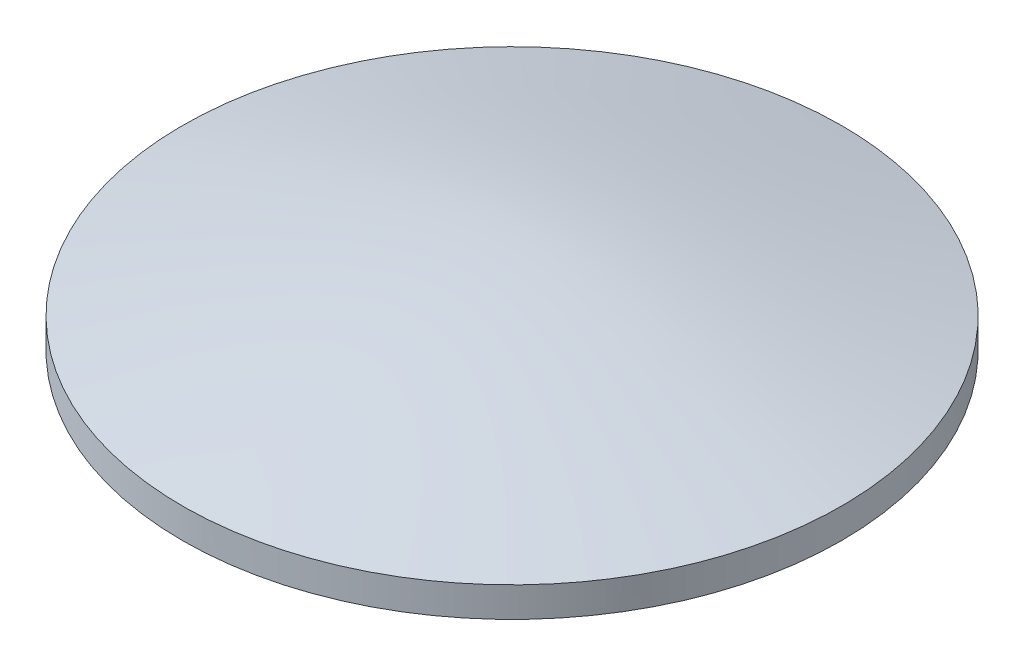
ISO-10303-21;
HEADER;
FILE_DESCRIPTION(('STEP AP214'),'2;1');
FILE_NAME('part.step','',(''),(''),'','','');
FILE_SCHEMA(('AUTOMOTIVE_DESIGN { 1 0 10303 214 1 1 1 1 }'));
ENDSEC;
DATA;
#1=APPLICATION_CONTEXT('core data for automotive mechanical design processes');
#2=APPLICATION_PROTOCOL_DEFINITION('international standard','automotive_design',2000,#1);
#3=PRODUCT_CONTEXT('',#1,'mechanical');
#4=PRODUCT('Part','Part','',(#3));
#5=PRODUCT_RELATED_PRODUCT_CATEGORY('part','',(#4));
#6=PRODUCT_DEFINITION_FORMATION('','',#4);
#7=PRODUCT_DEFINITION_CONTEXT('part definition',#1,'design');
#8=PRODUCT_DEFINITION('design','',#6,#7);
#9=PRODUCT_DEFINITION_SHAPE('','',#8);
#10=(LENGTH_UNIT() NAMED_UNIT(*) SI_UNIT(.MILLI.,.METRE.));
#11=(NAMED_UNIT(*) PLANE_ANGLE_UNIT() SI_UNIT($,.RADIAN.));
#12=(NAMED_UNIT(*) SI_UNIT($,.STERADIAN.) SOLID_ANGLE_UNIT());
#13=UNCERTAINTY_MEASURE_WITH_UNIT(LENGTH_MEASURE(1.E-05),#10,'distance_accuracy_value','');
#14=(GEOMETRIC_REPRESENTATION_CONTEXT(3) GLOBAL_UNCERTAINTY_ASSIGNED_CONTEXT((#13)) GLOBAL_UNIT_ASSIGNED_CONTEXT((#10,
#11,#12)) REPRESENTATION_CONTEXT('',''));
#15=CARTESIAN_POINT('',(0.,0.,0.));
#16=DIRECTION('',(0.,0.,1.));
#17=DIRECTION('',(1.,0.,0.));
#18=AXIS2_PLACEMENT_3D('',#15,#16,#17);
#19=CARTESIAN_POINT('',(-28.4340873573996,1.,-16.0558544303798));
#20=DIRECTION('',(0.,-1.,0.));
#21=DIRECTION('',(0.,0.,-1.));
#22=AXIS2_PLACEMENT_3D('',#19,#20,#21);
#23=CYLINDRICAL_SURFACE('',#22,11.);
#24=CARTESIAN_POINT('',(-28.4340873573996,1.0000956634017,-27.0558544303798));
#25=CARTESIAN_POINT('',(-28.7431360089541,1.00009506399083,-27.0558566478395));
#26=CARTESIAN_POINT('',(-29.0521482703003,1.0001055499279,-27.042824839222));
#27=CARTESIAN_POINT('',(-29.6680795303346,1.000133262005,-26.9907885775185));
#28=CARTESIAN_POINT('',(-29.9749979568717,1.00015048991772,-26.9517772916635));
#29=CARTESIAN_POINT('',(-30.5847830887726,1.00014861519526,-26.8479937883882));
#30=CARTESIAN_POINT('',(-30.8876450765097,1.00012947342816,-26.7831938830312));
#31=CARTESIAN_POINT('',(-31.4868292565492,1.00008695429055,-26.6282958337366));
#32=CARTESIAN_POINT('',(-31.7831514724804,1.00006357693535,-26.5381977812202));
#33=CARTESIAN_POINT('',(-32.367004806304,1.0000440919491,-26.3333941361263));
#34=CARTESIAN_POINT('',(-32.6545401111019,1.0000479711204,-26.2187004788546));
#35=CARTESIAN_POINT('',(-33.218929810395,1.0000685808711,-25.9654934856543));
#36=CARTESIAN_POINT('',(-33.4957840361391,1.00008531165347,-25.8269797735794));
#37=CARTESIAN_POINT('',(-34.0367687884912,1.00011881240857,-25.527157196353));
#38=CARTESIAN_POINT('',(-34.3009025399559,1.00013558237024,-25.365854149912));
#39=CARTESIAN_POINT('',(-34.8146434961776,1.00016288073817,-25.0215734577904));
#40=CARTESIAN_POINT('',(-35.0642507577696,1.00017340916885,-24.8385958969201));
#41=CARTESIAN_POINT('',(-35.547191392541,1.00018849202861,-24.4522456601396));
#42=CARTESIAN_POINT('',(-35.7805230338381,1.00019304582285,-24.2488708193592));
#43=CARTESIAN_POINT('',(-36.2292247278159,1.00019748302834,-23.8231878391572));
#44=CARTESIAN_POINT('',(-36.4445947622924,1.00019736643486,-23.600879680547));
#45=CARTESIAN_POINT('',(-36.8558499046767,1.00019175858853,-23.1389016512921));
#46=CARTESIAN_POINT('',(-37.0517342538632,1.00018626712648,-22.8992311052291));
#47=CARTESIAN_POINT('',(-37.4226157808268,1.00016832451178,-22.4042399806946));
#48=CARTESIAN_POINT('',(-37.5976129626853,1.00015587336049,-22.1489194052811));
#49=CARTESIAN_POINT('',(-37.9254729845027,1.00012601152596,-21.6244482959578));
#50=CARTESIAN_POINT('',(-38.0783362350655,1.00010860093474,-21.3552980187266));
#51=CARTESIAN_POINT('',(-38.3608454950461,1.00007908215073,-20.8050766443468));
#52=CARTESIAN_POINT('',(-38.4904915040763,1.00006697395802,-20.5240055469991));
#53=CARTESIAN_POINT('',(-38.7256443315021,1.00006201521133,-19.9519413679561));
#54=CARTESIAN_POINT('',(-38.8311511987088,1.0000691646184,-19.660948306325));
#55=CARTESIAN_POINT('',(-39.0172759888432,1.00010964745791,-19.0711084440512));
#56=CARTESIAN_POINT('',(-39.0978939117898,1.00014298089033,-18.7722616434144));
#57=CARTESIAN_POINT('',(-39.2336677977451,1.00017721337357,-18.1688383502115));
#58=CARTESIAN_POINT('',(-39.2888237129998,1.00017811236356,-17.8642618469004));
#59=CARTESIAN_POINT('',(-39.3732812336566,1.0001588091827,-17.2515450563576));
#60=CARTESIAN_POINT('',(-39.4025828390484,1.00013860701184,-16.9434047691244));
#61=CARTESIAN_POINT('',(-39.4351233937228,1.00011555429734,-16.3257516631627));
#62=CARTESIAN_POINT('',(-39.4383623900431,1.00011270372238,-16.0162388469122));
#63=CARTESIAN_POINT('',(-39.4187548228132,1.00012745235154,-15.3980405786056));
#64=CARTESIAN_POINT('',(-39.3959082592987,1.00014505155563,-15.0893551265484));
#65=CARTESIAN_POINT('',(-39.3242919839024,1.00017280277406,-14.4750060339404));
#66=CARTESIAN_POINT('',(-39.2755222623315,1.00018295478562,-14.1693423945191));
#67=CARTESIAN_POINT('',(-39.1524063883613,1.00016084331783,-13.5632101292597));
#68=CARTESIAN_POINT('',(-39.0780602359095,1.00012857983839,-13.2627415034322));
#69=CARTESIAN_POINT('',(-38.9043199637857,1.00008188042765,-12.6691350989574));
#70=CARTESIAN_POINT('',(-38.8049258176738,1.00006744451518,-12.3759973280485));
#71=CARTESIAN_POINT('',(-38.5817962306432,1.00006168675811,-11.7991369994387));
#72=CARTESIAN_POINT('',(-38.4580607897278,1.00007036491351,-11.5154144417363));
#73=CARTESIAN_POINT('',(-38.1871283459175,1.00009640273528,-10.9594017352974));
#74=CARTESIAN_POINT('',(-38.0399313511061,1.00011376239866,-10.6871115826219));
#75=CARTESIAN_POINT('',(-37.7231222513743,1.00014525944089,-10.155899402169));
#76=CARTESIAN_POINT('',(-37.5535101464645,1.00015939681975,-9.89697737438534));
#77=CARTESIAN_POINT('',(-37.1930767403467,1.00018065390576,-9.39434232661573));
#78=CARTESIAN_POINT('',(-37.0022554477397,1.00018777361577,-9.15062930046224));
#79=CARTESIAN_POINT('',(-36.6007602346459,1.00019619089425,-8.68014479433767));
#80=CARTESIAN_POINT('',(-36.3900863141571,1.00019748846273,-8.45337331436828));
#81=CARTESIAN_POINT('',(-35.9503835654484,1.00019545988342,-8.01838406522885));
#82=CARTESIAN_POINT('',(-35.7213547335217,1.0001921337347,-7.81016629980557));
#83=CARTESIAN_POINT('',(-35.2465704565373,1.00017990377595,-7.41376483458006));
#84=CARTESIAN_POINT('',(-35.0008150114766,1.00017099996592,-7.22558113478141));
#85=CARTESIAN_POINT('',(-34.4943246487363,1.00014663970354,-6.87058565066728));
#86=CARTESIAN_POINT('',(-34.2335897290857,1.00013118325032,-6.70377386916408));
#87=CARTESIAN_POINT('',(-33.6989941159469,1.00009789762164,-6.39270818256659));
#88=CARTESIAN_POINT('',(-33.4251334224642,1.00008006844618,-6.24845427746272));
#89=CARTESIAN_POINT('',(-32.8662332576089,1.00005389811139,-5.98352990749713));
#90=CARTESIAN_POINT('',(-32.5811937866834,1.00004555695167,-5.86285944169188));
#91=CARTESIAN_POINT('',(-32.0019625173287,1.00005309016004,-5.64595983828053));
#92=CARTESIAN_POINT('',(-31.7077707188932,1.00006896452814,-5.54973070069092));
#93=CARTESIAN_POINT('',(-31.1123263357209,1.00011256938021,-5.38239788894866));
#94=CARTESIAN_POINT('',(-30.8110737512988,1.00014029986365,-5.31129421367604));
#95=CARTESIAN_POINT('',(-30.2036495072558,1.00015545120841,-5.19471782484975));
#96=CARTESIAN_POINT('',(-29.8974778476374,1.00014287206976,-5.14924511128255));
#97=CARTESIAN_POINT('',(-29.2823921690229,1.00011607122002,-5.08425393168443));
#98=CARTESIAN_POINT('',(-28.9734781501816,1.00010184950903,-5.0647354641871));
#99=CARTESIAN_POINT('',(-28.3551039280975,1.00009285293018,-5.05179153645465));
#100=CARTESIAN_POINT('',(-28.0456437248546,1.00009807806233,-5.05836607622216));
#101=CARTESIAN_POINT('',(-27.4283771974375,1.00012199799311,-5.09756142283587));
#102=CARTESIAN_POINT('',(-27.120570873338,1.00014069279235,-5.13018223086158));
#103=CARTESIAN_POINT('',(-26.5088004354017,1.00015162240403,-5.22123820127415));
#104=CARTESIAN_POINT('',(-26.2048363215639,1.00014385721647,-5.27967336365478));
#105=CARTESIAN_POINT('',(-25.6029112932617,1.00010693210775,-5.42194260693135));
#106=CARTESIAN_POINT('',(-25.3049503791085,1.00007777218547,-5.50577668914386));
#107=CARTESIAN_POINT('',(-24.7171500872402,1.00004701759856,-5.69824776169827));
#108=CARTESIAN_POINT('',(-24.4273107095184,1.0000454229339,-5.80688475201972));
#109=CARTESIAN_POINT('',(-23.8578141143273,1.00005861817774,-6.04818928038284));
#110=CARTESIAN_POINT('',(-23.5781568955195,1.00007340808409,-6.18085681526575));
#111=CARTESIAN_POINT('',(-23.031012771872,1.00010591618853,-6.46927925608993));
#112=CARTESIAN_POINT('',(-22.7635258670468,1.00012363438662,-6.62503416205868));
#113=CARTESIAN_POINT('',(-22.2426240817851,1.00015355575114,-6.9585239962811));
#114=CARTESIAN_POINT('',(-21.9892091992304,1.00016575891839,-7.1362589212263));
#115=CARTESIAN_POINT('',(-21.4982530422028,1.00018384123542,-7.51244522370298));
#116=CARTESIAN_POINT('',(-21.2607117677282,1.0001897203852,-7.71089660123228));
#117=CARTESIAN_POINT('',(-20.8031915094302,1.00019661294383,-8.12710502360056));
#118=CARTESIAN_POINT('',(-20.5832125327195,1.0001976263507,-8.34486207625832));
#119=CARTESIAN_POINT('',(-20.1623808960434,1.00019465554787,-8.79813365761046));
#120=CARTESIAN_POINT('',(-19.9615282360889,1.00019067133818,-9.0336481863151));
#121=CARTESIAN_POINT('',(-19.580377104933,1.00017601118117,-9.52076044219662));
#122=CARTESIAN_POINT('',(-19.4000786413424,1.00016533523138,-9.77235817532881));
#123=CARTESIAN_POINT('',(-19.0613178041537,1.00013787038521,-10.2898480506865));
#124=CARTESIAN_POINT('',(-18.9028554305554,1.00012108148882,-10.5557401929117));
#125=CARTESIAN_POINT('',(-18.6088935021441,1.00008956976997,-11.0999282632746));
#126=CARTESIAN_POINT('',(-18.4733939230791,1.00007484694532,-11.3782241783116));
#127=CARTESIAN_POINT('',(-18.2263206996648,1.00006103985804,-11.945241540888));
#128=CARTESIAN_POINT('',(-18.1147470552644,1.00006195559537,-12.233962988405));
#129=CARTESIAN_POINT('',(-17.9163189617858,1.00009218637058,-12.8197786637177));
#130=CARTESIAN_POINT('',(-17.8294645029196,1.0001215013972,-13.1168728881979));
#131=CARTESIAN_POINT('',(-17.6810922026374,1.00016453486449,-13.7173220719364));
#132=CARTESIAN_POINT('',(-17.6195743612241,1.00017825330515,-14.0206770311954));
#133=CARTESIAN_POINT('',(-17.5223125628129,1.00017150505021,-14.6314915663245));
#134=CARTESIAN_POINT('',(-17.486568652329,1.00015103829293,-14.9389511496012));
#135=CARTESIAN_POINT('',(-17.441109014774,1.00012217171501,-15.5557885401376));
#136=CARTESIAN_POINT('',(-17.4313932877262,1.0001137718944,-15.8651663473991));
#137=CARTESIAN_POINT('',(-17.4380590839547,1.00011893182935,-16.483640110114));
#138=CARTESIAN_POINT('',(-17.4544405583223,1.00013249154376,-16.7927360660946));
#139=CARTESIAN_POINT('',(-17.51318420344,1.0001633062704,-17.4084492253858));
#140=CARTESIAN_POINT('',(-17.5555463741996,1.00018056128264,-17.7150664286954));
#141=CARTESIAN_POINT('',(-17.6659503550239,1.00017253589736,-18.3236428380727));
#142=CARTESIAN_POINT('',(-17.7339922170355,1.00014725541381,-18.6256020347165));
#143=CARTESIAN_POINT('',(-17.8952718325218,1.00009973430654,-19.2227150359415));
#144=CARTESIAN_POINT('',(-17.9885095855519,1.00007749368276,-19.5178688406428));
#145=CARTESIAN_POINT('',(-18.1995200803894,1.00005968339599,-20.0992780991519));
#146=CARTESIAN_POINT('',(-18.3172932778781,1.0000641142284,-20.3855333875798));
#147=CARTESIAN_POINT('',(-18.5765363096285,1.00008505052469,-20.9471047504165));
#148=CARTESIAN_POINT('',(-18.7180061485643,1.00010155599094,-21.2224208226676));
#149=CARTESIAN_POINT('',(-19.0236306839384,1.00013368294498,-21.760145807248));
#150=CARTESIAN_POINT('',(-19.1877844972399,1.00014930446714,-22.0225552215227));
#151=CARTESIAN_POINT('',(-19.5376140067928,1.00017376986174,-22.532612618397));
#152=CARTESIAN_POINT('',(-19.7232896812209,1.00018261374105,-22.7802606159644));
#153=CARTESIAN_POINT('',(-20.1148222245438,1.00019402125201,-23.2590094355213));
#154=CARTESIAN_POINT('',(-20.3206769462018,1.00019658555111,-23.4901120135774));
#155=CARTESIAN_POINT('',(-20.7511217983316,1.00019698222052,-23.9341572537898));
#156=CARTESIAN_POINT('',(-20.9757120020993,1.0001948145723,-24.147099844895));
#157=CARTESIAN_POINT('',(-21.4420903744871,1.00018528760271,-24.5533624136682));
#158=CARTESIAN_POINT('',(-21.6838829127976,1.00017792695795,-24.7466773750938));
#159=CARTESIAN_POINT('',(-22.1828916178447,1.00015665645298,-25.1122451613788));
#160=CARTESIAN_POINT('',(-22.4401075409704,1.00014274669618,-25.284498318777));
#161=CARTESIAN_POINT('',(-22.9682659307507,1.00011068680271,-25.606799341808));
#162=CARTESIAN_POINT('',(-23.2392149864085,1.00009253461519,-25.7568364104151));
#163=CARTESIAN_POINT('',(-23.7927954916742,1.00006247773773,-26.0335378804076));
#164=CARTESIAN_POINT('',(-24.0754269835025,1.00005057307036,-26.1602021973145));
#165=CARTESIAN_POINT('',(-24.6500568124817,1.0000469926597,-26.3891333537061));
#166=CARTESIAN_POINT('',(-24.9420447496538,1.00005529517596,-26.491426283787));
#167=CARTESIAN_POINT('',(-25.5334996779401,1.00009515460232,-26.6710373854205));
#168=CARTESIAN_POINT('',(-25.8329646815553,1.00012670539499,-26.7483621192753));
#169=CARTESIAN_POINT('',(-26.5126242383182,1.00015649570023,-26.893607036701));
#170=CARTESIAN_POINT('',(-26.8943631651927,1.00014449158326,-26.9543981753211));
#171=CARTESIAN_POINT('',(-27.662116099067,1.00011444972291,-27.0355204875212));
#172=CARTESIAN_POINT('',(-28.0481301060677,1.00009641197954,-27.0558516610919));
#173=CARTESIAN_POINT('',(-28.4340873573996,1.0000956634017,-27.0558544303798));
#174=B_SPLINE_CURVE_WITH_KNOTS('',3,(#24,#25,#26,#27,#28,#29,#30,#31,#32,#33,#34,#35,#36,#37,
#38,#39,#40,#41,#42,#43,#44,#45,#46,#47,#48,#49,#50,#51,#52,#53,#54,#55,#56,#57,#58,#59,#60,#61,
#62,#63,#64,#65,#66,#67,#68,#69,#70,#71,#72,#73,#74,#75,#76,#77,#78,#79,#80,#81,#82,#83,#84,#85,
#86,#87,#88,#89,#90,#91,#92,#93,#94,#95,#96,#97,#98,#99,#100,#101,#102,#103,#104,#105,#106,#107,
#108,#109,#110,#111,#112,#113,#114,#115,#116,#117,#118,#119,#120,#121,#122,#123,#124,#125,#126,
#127,#128,#129,#130,#131,#132,#133,#134,#135,#136,#137,#138,#139,#140,#141,#142,#143,#144,#145,
#146,#147,#148,#149,#150,#151,#152,#153,#154,#155,#156,#157,#158,#159,#160,#161,#162,#163,#164,
#165,#166,#167,#168,#169,#170,#171,#172,#173),.UNSPECIFIED.,.T.,.F.,(4,2,2,2,2,2,2,2,2,2,2,2,2,
2,2,2,2,2,2,2,2,2,2,2,2,2,2,2,2,2,2,2,2,2,2,2,2,2,2,2,2,2,2,2,2,2,2,2,2,2,2,2,2,2,2,2,2,2,2,2,2,
2,2,2,2,2,2,2,2,2,2,2,2,2,4),(0.,0.92680882205989,1.85386149709989,2.78191219857566,
3.70995954635372,4.63755756324455,5.56517022933102,6.4925464783389,7.41991909873659,
8.34739025042145,9.27486234209009,10.2023705329602,11.1298785425913,12.0573693439319,
12.9848601607513,13.9123491021028,14.8398380427549,15.7673287229048,16.6948194034209,
17.6223084100004,18.5497974153117,19.4772867672831,20.4047761211548,21.3322664540574,
22.2597567868305,23.1872468000385,24.1147368128051,25.0422264494515,25.9697160861898,
26.8972059102255,27.824695734426,28.752185680672,29.6796756265246,30.6071655352703,
31.5346554446419,32.4621453126709,33.3896351802105,34.3171249953469,35.2446148105767,
36.1721046678079,37.0995945248156,38.0270844299005,38.9545743342205,39.8820641166244,
40.8095539001324,41.737043544033,42.664533187836,43.5920232072733,44.5195132272456,
45.4470035906522,46.3744939540479,47.3019833378719,48.2294727197159,49.1569617343044,
50.0844507489976,51.0119414375215,51.9394321268742,52.8669210780194,53.7944100295014,
54.7219008571864,55.6493916685027,56.5768997070491,57.5044079285453,58.4318800502851,
59.359351231567,60.2867238282692,61.2141000531551,62.1417126945631,63.0693106882738,
63.9973580255596,64.925408717118,65.852461381641,66.7792701935055,67.9367209171734,
69.0941716411067),.UNSPECIFIED.);
#175=CARTESIAN_POINT('',(-28.4340873573996,1.0000956634017,-27.0558544303798));
#176=VERTEX_POINT('',#175);
#177=EDGE_CURVE('E12',#176,#176,#174,.T.);
#178=ORIENTED_EDGE('',*,*,#177,.F.);
#179=EDGE_LOOP('',(#178));
#180=FACE_BOUND('',#179,.T.);
#181=CARTESIAN_POINT('',(-28.4340873573996,0.,-16.0558544303798));
#182=DIRECTION('',(0.,1.,0.));
#183=DIRECTION('',(0.,0.,1.));
#184=AXIS2_PLACEMENT_3D('',#181,#182,#183);
#185=CIRCLE('',#184,11.);
#186=CARTESIAN_POINT('',(-28.4340873573996,0.,-5.05585443037976));
#187=VERTEX_POINT('',#186);
#188=EDGE_CURVE('E73',#187,#187,#185,.T.);
#189=ORIENTED_EDGE('',*,*,#188,.T.);
#190=EDGE_LOOP('',(#189));
#191=FACE_BOUND('',#190,.T.);
#192=ADVANCED_FACE('F61',(#180,#191),#23,.T.);
#193=CARTESIAN_POINT('',(-16.9985307538772,-0.207043537816972,-27.4793135553211));
#194=CARTESIAN_POINT('',(-16.9985307538772,0.0703739365187429,-25.6515646981496));
#195=CARTESIAN_POINT('',(-16.9985307538772,0.322393769766412,-23.8238158409781));
#196=CARTESIAN_POINT('',(-16.9985307538772,0.55717040388135,-21.9960669838065));
#197=CARTESIAN_POINT('',(-16.9985307538772,0.823636395255419,-19.2544398620806));
#198=CARTESIAN_POINT('',(-16.9985307538772,0.896954157966353,-16.5128127403547));
#199=CARTESIAN_POINT('',(-16.9985307538772,0.896954573121655,-15.5989344758004));
#200=CARTESIAN_POINT('',(-16.9985307538772,0.82363898670018,-12.8572996821373));
#201=CARTESIAN_POINT('',(-16.9985307538772,0.557173410899151,-10.1156648884742));
#202=CARTESIAN_POINT('',(-16.9985307538772,0.322395830368005,-8.2879083593655));
#203=CARTESIAN_POINT('',(-16.9985307538772,0.0703750226437707,-6.46015183025678));
#204=CARTESIAN_POINT('',(-16.9985307538772,-0.207043606338338,-4.63239530114806));
#205=CARTESIAN_POINT('',(-18.8282152032306,0.0711428249143574,-27.4793135553211));
#206=CARTESIAN_POINT('',(-18.8282152032306,0.393990999935086,-25.6515646981496));
#207=CARTESIAN_POINT('',(-18.8282152032306,0.690997111756618,-23.8238158409781));
#208=CARTESIAN_POINT('',(-18.8282152032306,0.972987952481149,-21.9960669838065));
#209=CARTESIAN_POINT('',(-18.8282152032306,1.29636265137287,-19.2544398620806));
#210=CARTESIAN_POINT('',(-18.8282152032306,1.38561157288069,-16.5128127403547));
#211=CARTESIAN_POINT('',(-18.8282152032306,1.38561207796633,-15.5989344758004));
#212=CARTESIAN_POINT('',(-18.8282152032306,1.29636578958348,-12.8572996821373));
#213=CARTESIAN_POINT('',(-18.8282152032306,0.972991570887368,-10.1156648884742));
#214=CARTESIAN_POINT('',(-18.8282152032306,0.690999544728149,-8.2879083593655));
#215=CARTESIAN_POINT('',(-18.8282152032306,0.393992285425408,-6.46015183025678));
#216=CARTESIAN_POINT('',(-18.8282152032306,0.0711427774329192,-4.63239530114806));
#217=CARTESIAN_POINT('',(-20.657899652584,0.323873650874634,-27.4793135553211));
#218=CARTESIAN_POINT('',(-20.657899652584,0.691693386712113,-25.6515646981496));
#219=CARTESIAN_POINT('',(-20.657899652584,1.03298149833137,-23.8238158409781));
#220=CARTESIAN_POINT('',(-20.657899652584,1.36335354398331,-21.9960669838065));
#221=CARTESIAN_POINT('',(-20.657899652584,1.74565246064231,-19.2544398620806));
#222=CARTESIAN_POINT('',(-20.657899652584,1.85141642331798,-16.5128127403547));
#223=CARTESIAN_POINT('',(-20.657899652584,1.85141700879609,-15.5989344758004));
#224=CARTESIAN_POINT('',(-20.657899652584,1.74565618229641,-12.8572996821373));
#225=CARTESIAN_POINT('',(-20.657899652584,1.36335780313615,-10.1156648884742));
#226=CARTESIAN_POINT('',(-20.657899652584,1.03298429360168,-8.2879083593655));
#227=CARTESIAN_POINT('',(-20.657899652584,0.691694861734403,-6.46015183025678));
#228=CARTESIAN_POINT('',(-20.657899652584,0.323873638367364,-4.63239530114806));
#229=CARTESIAN_POINT('',(-22.4875841019373,0.559409523540686,-27.4793135553211));
#230=CARTESIAN_POINT('',(-22.4875841019373,0.974424776720699,-25.6515646981496));
#231=CARTESIAN_POINT('',(-22.4875841019373,1.36400209101423,-23.8238158409781));
#232=CARTESIAN_POINT('',(-22.4875841019373,1.74665546221893,-21.9960669838065));
#233=CARTESIAN_POINT('',(-22.4875841019373,2.18347196585509,-19.2544398620806));
#234=CARTESIAN_POINT('',(-22.4875841019373,2.3060781276267,-16.5128127403547));
#235=CARTESIAN_POINT('',(-22.4875841019373,2.30607883258692,-15.5989344758004));
#236=CARTESIAN_POINT('',(-22.4875841019373,2.18347620064864,-12.8572996821373));
#237=CARTESIAN_POINT('',(-22.4875841019373,1.7466603763759,-10.1156648884742));
#238=CARTESIAN_POINT('',(-22.4875841019373,1.36400530960581,-8.2879083593655));
#239=CARTESIAN_POINT('',(-22.4875841019373,0.974426552212762,-6.46015183025678));
#240=CARTESIAN_POINT('',(-22.4875841019373,0.55940960478035,-4.63239530114806));
#241=CARTESIAN_POINT('',(-25.2321146153071,0.826627466160816,-27.4793135553211));
#242=CARTESIAN_POINT('',(-25.2321146153071,1.29857996832819,-25.6515646981496));
#243=CARTESIAN_POINT('',(-25.2321146153071,1.74716175087929,-23.8238158409781));
#244=CARTESIAN_POINT('',(-25.2321146153071,2.18422701051386,-21.9960669838065));
#245=CARTESIAN_POINT('',(-25.2321146153071,2.72440724596479,-19.2544398620806));
#246=CARTESIAN_POINT('',(-25.2321146153071,2.87853412997979,-16.5128127403547));
#247=CARTESIAN_POINT('',(-25.2321146153071,2.87853497782703,-15.5989344758004));
#248=CARTESIAN_POINT('',(-25.2321146153071,2.72441267154999,-12.8572996821373));
#249=CARTESIAN_POINT('',(-25.2321146153071,2.18423265822733,-10.1156648884742));
#250=CARTESIAN_POINT('',(-25.2321146153071,1.74716550653926,-8.2879083593655));
#251=CARTESIAN_POINT('',(-25.2321146153071,1.29858193919459,-6.46015183025678));
#252=CARTESIAN_POINT('',(-25.2321146153071,0.826627471598921,-4.63239530114806));
#253=CARTESIAN_POINT('',(-27.9766451286769,0.900234389997562,-27.4793135553211));
#254=CARTESIAN_POINT('',(-27.9766451286769,1.38807337162942,-25.6515646981496));
#255=CARTESIAN_POINT('',(-27.9766451286769,1.853106849877,-23.8238158409781));
#256=CARTESIAN_POINT('',(-27.9766451286769,2.30705729201015,-21.9960669838065));
#257=CARTESIAN_POINT('',(-27.9766451286769,2.87873889366122,-19.2544398620806));
#258=CARTESIAN_POINT('',(-27.9766451286769,3.05616069684402,-16.5128127403547));
#259=CARTESIAN_POINT('',(-27.9766451286769,3.0561617736686,-15.5989344758004));
#260=CARTESIAN_POINT('',(-27.9766451286769,2.87874474306615,-12.8572996821373));
#261=CARTESIAN_POINT('',(-27.9766451286769,2.30706313394658,-10.1156648884742));
#262=CARTESIAN_POINT('',(-27.9766451286769,1.85311072960656,-8.2879083593655));
#263=CARTESIAN_POINT('',(-27.9766451286769,1.38807540098655,-6.46015183025678));
#264=CARTESIAN_POINT('',(-27.9766451286769,0.900234388109237,-4.63239530114806));
#265=CARTESIAN_POINT('',(-28.8914911926932,0.90023480349722,-27.4793135553211));
#266=CARTESIAN_POINT('',(-28.8914911926932,1.38807387779572,-25.6515646981496));
#267=CARTESIAN_POINT('',(-28.8914911926932,1.85310743413994,-23.8238158409781));
#268=CARTESIAN_POINT('',(-28.8914911926932,2.30705800079109,-21.9960669838065));
#269=CARTESIAN_POINT('',(-28.8914911926932,2.87873974094554,-19.2544398620806));
#270=CARTESIAN_POINT('',(-28.8914911926932,3.05616177480763,-16.5128127403547));
#271=CARTESIAN_POINT('',(-28.8914911926932,3.05616285155521,-15.5989344758004));
#272=CARTESIAN_POINT('',(-28.8914911926932,2.87874559253569,-12.8572996821373));
#273=CARTESIAN_POINT('',(-28.8914911926932,2.30706383910976,-10.1156648884742));
#274=CARTESIAN_POINT('',(-28.8914911926932,1.85311131482243,-8.2879083593655));
#275=CARTESIAN_POINT('',(-28.8914911926932,1.38807590917515,-6.46015183025678));
#276=CARTESIAN_POINT('',(-28.8914911926932,0.900234809337481,-4.63239530114805));
#277=CARTESIAN_POINT('',(-31.6360293847424,0.826630064467274,-27.4793135553211));
#278=CARTESIAN_POINT('',(-31.6360293847424,1.29858311552842,-25.6515646981496));
#279=CARTESIAN_POINT('',(-31.6360293847424,1.7471655130139,-23.8238158409781));
#280=CARTESIAN_POINT('',(-31.6360293847424,2.1842312358001,-21.9960669838065));
#281=CARTESIAN_POINT('',(-31.6360293847424,2.72441267884336,-19.2544398620806));
#282=CARTESIAN_POINT('',(-31.6360293847424,2.87853998834,-16.5128127403547));
#283=CARTESIAN_POINT('',(-31.6360293847424,2.87854083510096,-15.5989344758004));
#284=CARTESIAN_POINT('',(-31.6360293847424,2.72441810904756,-12.8572996821373));
#285=CARTESIAN_POINT('',(-31.6360293847424,2.18423689819382,-10.1156648884742));
#286=CARTESIAN_POINT('',(-31.6360293847424,1.7471692136932,-8.2879083593655));
#287=CARTESIAN_POINT('',(-31.6360293847424,1.29858508044512,-6.46015183025678));
#288=CARTESIAN_POINT('',(-31.6360293847424,0.826630071313387,-4.63239530114805));
#289=CARTESIAN_POINT('',(-34.3805675767916,0.559412592756266,-27.4793135553211));
#290=CARTESIAN_POINT('',(-34.3805675767916,0.974428433839653,-25.6515646981496));
#291=CARTESIAN_POINT('',(-34.3805675767916,1.36400628899051,-23.8238158409781));
#292=CARTESIAN_POINT('',(-34.3805675767916,1.74666038518597,-21.9960669838065));
#293=CARTESIAN_POINT('',(-34.3805675767916,2.18347763975296,-19.2544398620806));
#294=CARTESIAN_POINT('',(-34.3805675767916,2.30608397653067,-16.5128127403547));
#295=CARTESIAN_POINT('',(-34.3805675767916,2.30608468281544,-15.5989344758004));
#296=CARTESIAN_POINT('',(-34.3805675767916,2.18348185573684,-12.8572996821373));
#297=CARTESIAN_POINT('',(-34.3805675767916,1.74666532791086,-10.1156648884742));
#298=CARTESIAN_POINT('',(-34.3805675767916,1.36400957299419,-8.2879083593655));
#299=CARTESIAN_POINT('',(-34.3805675767916,0.9744301317841,-6.46015183025678));
#300=CARTESIAN_POINT('',(-34.3805675767916,0.559412550099978,-4.63239530114806));
#301=CARTESIAN_POINT('',(-36.2102597048243,0.323875675226112,-27.4793135553211));
#302=CARTESIAN_POINT('',(-36.2102597048243,0.691695774180714,-25.6515646981496));
#303=CARTESIAN_POINT('',(-36.2102597048243,1.03298430002833,-23.8238158409781));
#304=CARTESIAN_POINT('',(-36.2102597048243,1.36335683944753,-21.9960669838065));
#305=CARTESIAN_POINT('',(-36.2102597048243,1.74565619049794,-19.2544398620806));
#306=CARTESIAN_POINT('',(-36.2102597048243,1.85142031209462,-16.5128127403547));
#307=CARTESIAN_POINT('',(-36.2102597048243,1.85142089492277,-15.5989344758004));
#308=CARTESIAN_POINT('',(-36.2102597048243,1.74565992262057,-12.8572996821373));
#309=CARTESIAN_POINT('',(-36.2102597048243,1.36336102400291,-10.1156648884742));
#310=CARTESIAN_POINT('',(-36.2102597048243,1.03298718566467,-8.2879083593655));
#311=CARTESIAN_POINT('',(-36.2102597048243,0.69169735738453,-6.46015183025678));
#312=CARTESIAN_POINT('',(-36.2102597048243,0.32387572101373,-4.63239530114805));
#313=CARTESIAN_POINT('',(-38.0399518328571,0.07114389255645,-27.4793135553211));
#314=CARTESIAN_POINT('',(-38.0399518328571,0.393992289002205,-25.6515646981496));
#315=CARTESIAN_POINT('',(-38.0399518328571,0.690998642400685,-23.8238158409781));
#316=CARTESIAN_POINT('',(-38.0399518328571,0.9729897015159,-21.9960669838065));
#317=CARTESIAN_POINT('',(-38.0399518328571,1.29636462444111,-19.2544398620806));
#318=CARTESIAN_POINT('',(-38.0399518328571,1.38561360746678,-16.5128127403547));
#319=CARTESIAN_POINT('',(-38.0399518328571,1.38561411338821,-15.5989344758004));
#320=CARTESIAN_POINT('',(-38.0399518328571,1.29636776054677,-12.8572996821373));
#321=CARTESIAN_POINT('',(-38.0399518328571,0.972993302707523,-10.1156648884742));
#322=CARTESIAN_POINT('',(-38.0399518328571,0.691001080106108,-8.2879083593655));
#323=CARTESIAN_POINT('',(-38.0399518328571,0.393993646464317,-6.46015183025678));
#324=CARTESIAN_POINT('',(-38.0399518328571,0.0711439316718341,-4.63239530114805));
#325=CARTESIAN_POINT('',(-39.8696439608899,-0.207043606602529,-27.4793135553211));
#326=CARTESIAN_POINT('',(-39.8696439608899,0.0703739107552754,-25.6515646981496));
#327=CARTESIAN_POINT('',(-39.8696439608899,0.322393799562262,-23.8238158409781));
#328=CARTESIAN_POINT('',(-39.8696439608899,0.557170431106969,-21.9960669838065));
#329=CARTESIAN_POINT('',(-39.8696439608899,0.823636401864032,-19.2544398620806));
#330=CARTESIAN_POINT('',(-39.8696439608899,0.896954161224111,-16.5128127403547));
#331=CARTESIAN_POINT('',(-39.8696439608899,0.896954576528213,-15.5989344758004));
#332=CARTESIAN_POINT('',(-39.8696439608899,0.823638994398195,-12.8572996821373));
#333=CARTESIAN_POINT('',(-39.8696439608899,0.557173422419802,-10.1156648884742));
#334=CARTESIAN_POINT('',(-39.8696439608899,0.322395834470254,-8.2879083593655));
#335=CARTESIAN_POINT('',(-39.8696439608899,0.0703750403152262,-6.46015183025678));
#336=CARTESIAN_POINT('',(-39.8696439608899,-0.207043593583405,-4.63239530114806));
#337=B_SPLINE_SURFACE_WITH_KNOTS('',5,5,((#193,#194,#195,#196,#197,#198,#199,#200,#201,#202,
#203,#204),(#205,#206,#207,#208,#209,#210,#211,#212,#213,#214,#215,#216),(#217,#218,#219,#220,
#221,#222,#223,#224,#225,#226,#227,#228),(#229,#230,#231,#232,#233,#234,#235,#236,#237,#238,
#239,#240),(#241,#242,#243,#244,#245,#246,#247,#248,#249,#250,#251,#252),(#253,#254,#255,#256,
#257,#258,#259,#260,#261,#262,#263,#264),(#265,#266,#267,#268,#269,#270,#271,#272,#273,#274,
#275,#276),(#277,#278,#279,#280,#281,#282,#283,#284,#285,#286,#287,#288),(#289,#290,#291,#292,
#293,#294,#295,#296,#297,#298,#299,#300),(#301,#302,#303,#304,#305,#306,#307,#308,#309,#310,
#311,#312),(#313,#314,#315,#316,#317,#318,#319,#320,#321,#322,#323,#324),(#325,#326,#327,#328,
#329,#330,#331,#332,#333,#334,#335,#336)),.UNSPECIFIED.,.F.,.F.,.F.,(6,3,3,6),(6,3,3,6),
(-11.4355566034642,-2.28713435669738,2.28709596338456,11.4355566035484),(-11.4234591249475,
-2.28471483908983,2.28467648368197,11.4234591292256),.UNSPECIFIED.);
#338=ORIENTED_EDGE('',*,*,#177,.T.);
#339=EDGE_LOOP('',(#338));
#340=FACE_BOUND('',#339,.T.);
#341=ADVANCED_FACE('F63',(#340),#337,.T.);
#342=CARTESIAN_POINT('',(-28.4340873573996,0.,-16.0558544303798));
#343=DIRECTION('',(0.,1.,0.));
#344=DIRECTION('',(0.,0.,1.));
#345=AXIS2_PLACEMENT_3D('',#342,#343,#344);
#346=PLANE('',#345);
#347=ORIENTED_EDGE('',*,*,#188,.F.);
#348=EDGE_LOOP('',(#347));
#349=FACE_BOUND('',#348,.T.);
#350=ADVANCED_FACE('F80',(#349),#346,.F.);
#351=CLOSED_SHELL('',(#192,#341,#350));
#352=MANIFOLD_SOLID_BREP('B2',#351);
#353=ADVANCED_BREP_SHAPE_REPRESENTATION('',(#18,#352),#14);
#354=SHAPE_DEFINITION_REPRESENTATION(#9,#353);
ENDSEC;
END-ISO-10303-21;
